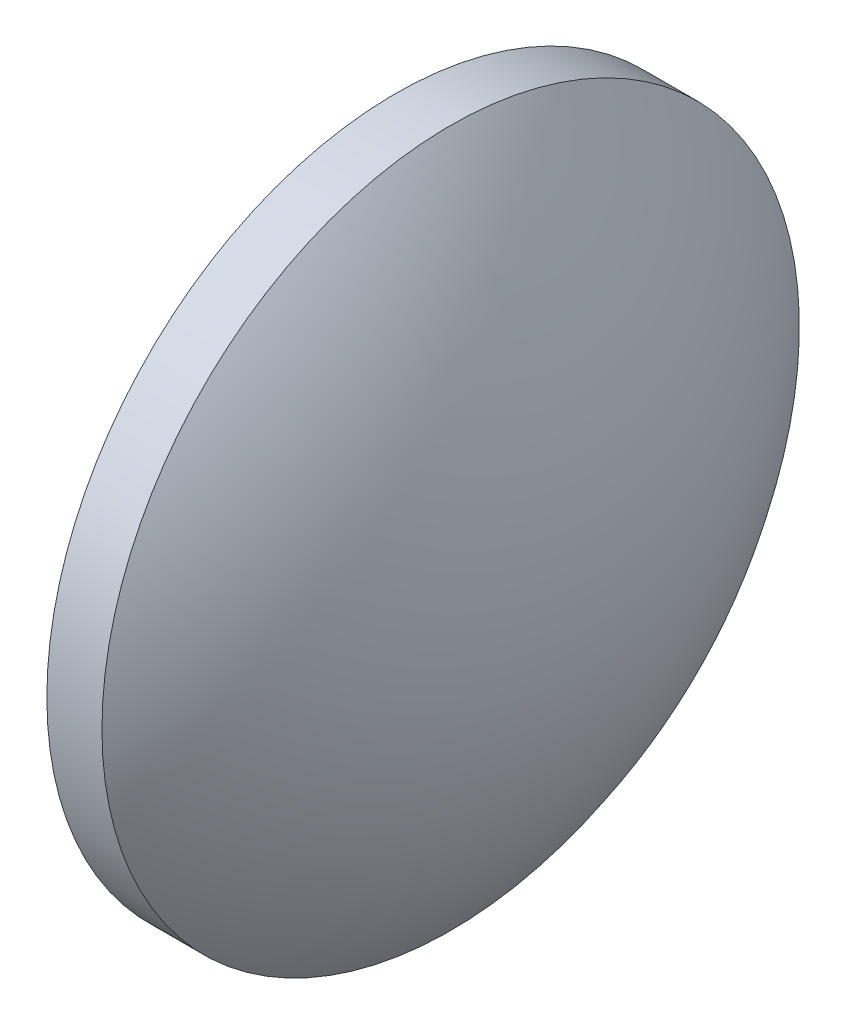
ISO-10303-21;
HEADER;
FILE_DESCRIPTION(('STEP AP214'),'2;1');
FILE_NAME('part.step','',(''),(''),'','','');
FILE_SCHEMA(('AUTOMOTIVE_DESIGN { 1 0 10303 214 1 1 1 1 }'));
ENDSEC;
DATA;
#1=APPLICATION_CONTEXT('core data for automotive mechanical design processes');
#2=APPLICATION_PROTOCOL_DEFINITION('international standard','automotive_design',2000,#1);
#3=PRODUCT_CONTEXT('',#1,'mechanical');
#4=PRODUCT('Part','Part','',(#3));
#5=PRODUCT_RELATED_PRODUCT_CATEGORY('part','',(#4));
#6=PRODUCT_DEFINITION_FORMATION('','',#4);
#7=PRODUCT_DEFINITION_CONTEXT('part definition',#1,'design');
#8=PRODUCT_DEFINITION('design','',#6,#7);
#9=PRODUCT_DEFINITION_SHAPE('','',#8);
#10=(LENGTH_UNIT() NAMED_UNIT(*) SI_UNIT(.MILLI.,.METRE.));
#11=(NAMED_UNIT(*) PLANE_ANGLE_UNIT() SI_UNIT($,.RADIAN.));
#12=(NAMED_UNIT(*) SI_UNIT($,.STERADIAN.) SOLID_ANGLE_UNIT());
#13=UNCERTAINTY_MEASURE_WITH_UNIT(LENGTH_MEASURE(1.E-05),#10,'distance_accuracy_value','');
#14=(GEOMETRIC_REPRESENTATION_CONTEXT(3) GLOBAL_UNCERTAINTY_ASSIGNED_CONTEXT((#13)) GLOBAL_UNIT_ASSIGNED_CONTEXT((#10,
#11,#12)) REPRESENTATION_CONTEXT('',''));
#15=CARTESIAN_POINT('',(0.,0.,0.));
#16=DIRECTION('',(0.,0.,1.));
#17=DIRECTION('',(1.,0.,0.));
#18=AXIS2_PLACEMENT_3D('',#15,#16,#17);
#19=CARTESIAN_POINT('',(0.,0.,0.));
#20=DIRECTION('',(0.,1.,0.));
#21=DIRECTION('',(1.,0.,0.));
#22=AXIS2_PLACEMENT_3D('',#19,#20,#21);
#23=SPHERICAL_SURFACE('',#22,500.);
#24=CARTESIAN_POINT('',(0.,0.,0.));
#25=DIRECTION('',(1.,0.,0.));
#26=DIRECTION('',(0.,0.,-1.));
#27=AXIS2_PLACEMENT_3D('',#24,#25,#26);
#28=SPHERICAL_SURFACE('',#27,500.);
#29=CARTESIAN_POINT('',(400.,0.,0.));
#30=DIRECTION('',(1.,0.,0.));
#31=DIRECTION('',(0.,0.,-1.));
#32=AXIS2_PLACEMENT_3D('',#29,#30,#31);
#33=CIRCLE('',#32,300.);
#34=CARTESIAN_POINT('',(400.,0.,-300.));
#35=VERTEX_POINT('',#34);
#36=EDGE_CURVE('E10',#35,#35,#33,.T.);
#37=ORIENTED_EDGE('',*,*,#36,.F.);
#38=EDGE_LOOP('',(#37));
#39=FACE_BOUND('',#38,.T.);
#40=ADVANCED_FACE('F37',(#39),#28,.F.);
#41=CARTESIAN_POINT('',(350.,0.,0.));
#42=DIRECTION('',(-1.,0.,0.));
#43=DIRECTION('',(0.,0.,1.));
#44=AXIS2_PLACEMENT_3D('',#41,#42,#43);
#45=PLANE('',#44);
#46=CARTESIAN_POINT('',(350.,0.,0.));
#47=DIRECTION('',(-1.,0.,0.));
#48=DIRECTION('',(0.,0.,1.));
#49=AXIS2_PLACEMENT_3D('',#46,#47,#48);
#50=CIRCLE('',#49,316.385840391127);
#51=CARTESIAN_POINT('',(350.,0.,316.385840391127));
#52=VERTEX_POINT('',#51);
#53=EDGE_CURVE('E43',#52,#52,#50,.T.);
#54=ORIENTED_EDGE('',*,*,#53,.T.);
#55=EDGE_LOOP('',(#54));
#56=FACE_BOUND('',#55,.T.);
#57=CARTESIAN_POINT('',(350.,0.,0.));
#58=DIRECTION('',(-1.,0.,0.));
#59=DIRECTION('',(0.,0.,1.));
#60=AXIS2_PLACEMENT_3D('',#57,#58,#59);
#61=CIRCLE('',#60,300.);
#62=CARTESIAN_POINT('',(350.,0.,300.));
#63=VERTEX_POINT('',#62);
#64=EDGE_CURVE('E52',#63,#63,#61,.T.);
#65=ORIENTED_EDGE('',*,*,#64,.F.);
#66=EDGE_LOOP('',(#65));
#67=FACE_BOUND('',#66,.T.);
#68=ADVANCED_FACE('F59',(#56,#67),#45,.T.);
#69=CARTESIAN_POINT('',(350.,0.,0.));
#70=DIRECTION('',(1.,0.,0.));
#71=DIRECTION('',(0.,0.,-1.));
#72=AXIS2_PLACEMENT_3D('',#69,#70,#71);
#73=CYLINDRICAL_SURFACE('',#72,316.385840391127);
#74=ORIENTED_EDGE('',*,*,#53,.F.);
#75=EDGE_LOOP('',(#74));
#76=FACE_BOUND('',#75,.T.);
#77=CARTESIAN_POINT('',(400.,0.,0.));
#78=DIRECTION('',(-1.,0.,0.));
#79=DIRECTION('',(0.,0.,1.));
#80=AXIS2_PLACEMENT_3D('',#77,#78,#79);
#81=CIRCLE('',#80,316.385840391127);
#82=CARTESIAN_POINT('',(400.,0.,316.385840391127));
#83=VERTEX_POINT('',#82);
#84=EDGE_CURVE('E47',#83,#83,#81,.T.);
#85=ORIENTED_EDGE('',*,*,#84,.T.);
#86=EDGE_LOOP('',(#85));
#87=FACE_BOUND('',#86,.T.);
#88=ADVANCED_FACE('F61',(#76,#87),#73,.T.);
#89=CARTESIAN_POINT('',(350.,0.,0.));
#90=DIRECTION('',(1.,0.,0.));
#91=DIRECTION('',(0.,0.,-1.));
#92=AXIS2_PLACEMENT_3D('',#89,#90,#91);
#93=CYLINDRICAL_SURFACE('',#92,300.);
#94=ORIENTED_EDGE('',*,*,#64,.T.);
#95=EDGE_LOOP('',(#94));
#96=FACE_BOUND('',#95,.T.);
#97=ORIENTED_EDGE('',*,*,#36,.T.);
#98=EDGE_LOOP('',(#97));
#99=FACE_BOUND('',#98,.T.);
#100=ADVANCED_FACE('F57',(#96,#99),#93,.F.);
#101=CARTESIAN_POINT('',(0.,0.,0.));
#102=DIRECTION('',(0.,1.,0.));
#103=DIRECTION('',(1.,0.,0.));
#104=AXIS2_PLACEMENT_3D('',#101,#102,#103);
#105=SPHERICAL_SURFACE('',#104,510.);
#106=CARTESIAN_POINT('',(0.,0.,0.));
#107=DIRECTION('',(-1.,0.,0.));
#108=DIRECTION('',(0.,0.,1.));
#109=AXIS2_PLACEMENT_3D('',#106,#107,#108);
#110=SPHERICAL_SURFACE('',#109,510.);
#111=ORIENTED_EDGE('',*,*,#84,.F.);
#112=EDGE_LOOP('',(#111));
#113=FACE_BOUND('',#112,.T.);
#114=ADVANCED_FACE('F71',(#113),#110,.T.);
#115=CLOSED_SHELL('',(#40,#68,#88,#100,#114));
#116=MANIFOLD_SOLID_BREP('B2',#115);
#117=ADVANCED_BREP_SHAPE_REPRESENTATION('',(#18,#116),#14);
#118=SHAPE_DEFINITION_REPRESENTATION(#9,#117);
ENDSEC;
END-ISO-10303-21;
